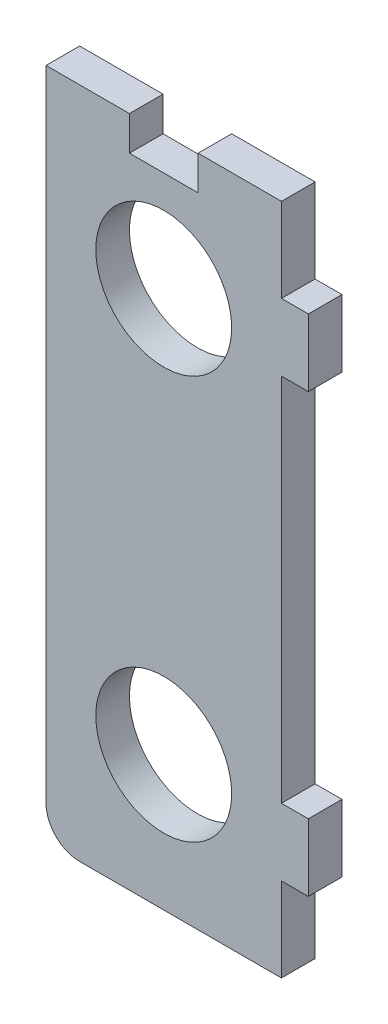
ISO-10303-21;
HEADER;
FILE_DESCRIPTION(('STEP AP214'),'2;1');
FILE_NAME('part.step','',(''),(''),'','','');
FILE_SCHEMA(('AUTOMOTIVE_DESIGN { 1 0 10303 214 1 1 1 1 }'));
ENDSEC;
DATA;
#1=APPLICATION_CONTEXT('core data for automotive mechanical design processes');
#2=APPLICATION_PROTOCOL_DEFINITION('international standard','automotive_design',2000,#1);
#3=PRODUCT_CONTEXT('',#1,'mechanical');
#4=PRODUCT('Part','Part','',(#3));
#5=PRODUCT_RELATED_PRODUCT_CATEGORY('part','',(#4));
#6=PRODUCT_DEFINITION_FORMATION('','',#4);
#7=PRODUCT_DEFINITION_CONTEXT('part definition',#1,'design');
#8=PRODUCT_DEFINITION('design','',#6,#7);
#9=PRODUCT_DEFINITION_SHAPE('','',#8);
#10=(LENGTH_UNIT() NAMED_UNIT(*) SI_UNIT(.MILLI.,.METRE.));
#11=(NAMED_UNIT(*) PLANE_ANGLE_UNIT() SI_UNIT($,.RADIAN.));
#12=(NAMED_UNIT(*) SI_UNIT($,.STERADIAN.) SOLID_ANGLE_UNIT());
#13=UNCERTAINTY_MEASURE_WITH_UNIT(LENGTH_MEASURE(1.E-05),#10,'distance_accuracy_value','');
#14=(GEOMETRIC_REPRESENTATION_CONTEXT(3) GLOBAL_UNCERTAINTY_ASSIGNED_CONTEXT((#13)) GLOBAL_UNIT_ASSIGNED_CONTEXT((#10,
#11,#12)) REPRESENTATION_CONTEXT('',''));
#15=CARTESIAN_POINT('',(0.,0.,0.));
#16=DIRECTION('',(0.,0.,1.));
#17=DIRECTION('',(1.,0.,0.));
#18=AXIS2_PLACEMENT_3D('',#15,#16,#17);
#19=CARTESIAN_POINT('',(-35.,0.,-20.));
#20=DIRECTION('',(-1.,0.,0.));
#21=DIRECTION('',(0.,-1.,0.));
#22=AXIS2_PLACEMENT_3D('',#19,#20,#21);
#23=PLANE('',#22);
#24=DIRECTION('',(0.,0.,-1.));
#25=VECTOR('',#24,1.);
#26=CARTESIAN_POINT('',(-35.,-95.,-20.));
#27=LINE('',#26,#25);
#28=CARTESIAN_POINT('',(-35.,-95.,-15.));
#29=VERTEX_POINT('',#28);
#30=CARTESIAN_POINT('',(-35.,-95.,-20.));
#31=VERTEX_POINT('',#30);
#32=EDGE_CURVE('E11',#29,#31,#27,.T.);
#33=ORIENTED_EDGE('',*,*,#32,.F.);
#34=DIRECTION('',(0.,1.,0.));
#35=VECTOR('',#34,1.);
#36=CARTESIAN_POINT('',(-35.,0.,-15.));
#37=LINE('',#36,#35);
#38=CARTESIAN_POINT('',(-35.,0.,-15.));
#39=VERTEX_POINT('',#38);
#40=EDGE_CURVE('E131',#39,#29,#37,.F.);
#41=ORIENTED_EDGE('',*,*,#40,.F.);
#42=DIRECTION('',(0.,0.,-1.));
#43=VECTOR('',#42,1.);
#44=CARTESIAN_POINT('',(-35.,0.,-20.));
#45=LINE('',#44,#43);
#46=CARTESIAN_POINT('',(-35.,0.,-20.));
#47=VERTEX_POINT('',#46);
#48=EDGE_CURVE('E47',#39,#47,#45,.T.);
#49=ORIENTED_EDGE('',*,*,#48,.T.);
#50=DIRECTION('',(0.,-1.,0.));
#51=VECTOR('',#50,1.);
#52=CARTESIAN_POINT('',(-35.,0.,-20.));
#53=LINE('',#52,#51);
#54=EDGE_CURVE('E226',#47,#31,#53,.T.);
#55=ORIENTED_EDGE('',*,*,#54,.T.);
#56=EDGE_LOOP('',(#33,#41,#49,#55));
#57=FACE_BOUND('',#56,.T.);
#58=ADVANCED_FACE('F37',(#57),#23,.T.);
#59=CARTESIAN_POINT('',(-35.,0.,-20.));
#60=DIRECTION('',(0.,1.,0.));
#61=DIRECTION('',(-1.,0.,0.));
#62=AXIS2_PLACEMENT_3D('',#59,#60,#61);
#63=PLANE('',#62);
#64=ORIENTED_EDGE('',*,*,#48,.F.);
#65=DIRECTION('',(1.,0.,0.));
#66=VECTOR('',#65,1.);
#67=CARTESIAN_POINT('',(0.,0.,-15.));
#68=LINE('',#67,#66);
#69=CARTESIAN_POINT('',(-22.6,0.,-15.));
#70=VERTEX_POINT('',#69);
#71=EDGE_CURVE('E180',#70,#39,#68,.F.);
#72=ORIENTED_EDGE('',*,*,#71,.F.);
#73=DIRECTION('',(0.,0.,-1.));
#74=VECTOR('',#73,1.);
#75=CARTESIAN_POINT('',(-22.6,0.,-20.));
#76=LINE('',#75,#74);
#77=CARTESIAN_POINT('',(-22.6,0.,-20.));
#78=VERTEX_POINT('',#77);
#79=EDGE_CURVE('E219',#70,#78,#76,.T.);
#80=ORIENTED_EDGE('',*,*,#79,.T.);
#81=DIRECTION('',(-1.,0.,0.));
#82=VECTOR('',#81,1.);
#83=CARTESIAN_POINT('',(-35.,0.,-20.));
#84=LINE('',#83,#82);
#85=EDGE_CURVE('E236',#78,#47,#84,.T.);
#86=ORIENTED_EDGE('',*,*,#85,.T.);
#87=EDGE_LOOP('',(#64,#72,#80,#86));
#88=FACE_BOUND('',#87,.T.);
#89=ADVANCED_FACE('F239',(#88),#63,.T.);
#90=CARTESIAN_POINT('',(-22.6,-16.5595774569303,-20.));
#91=DIRECTION('',(1.,0.,0.));
#92=DIRECTION('',(0.,1.,0.));
#93=AXIS2_PLACEMENT_3D('',#90,#91,#92);
#94=PLANE('',#93);
#95=ORIENTED_EDGE('',*,*,#79,.F.);
#96=DIRECTION('',(0.,1.,0.));
#97=VECTOR('',#96,1.);
#98=CARTESIAN_POINT('',(-22.6,0.,-15.));
#99=LINE('',#98,#97);
#100=CARTESIAN_POINT('',(-22.6,-5.1,-15.));
#101=VERTEX_POINT('',#100);
#102=EDGE_CURVE('E177',#101,#70,#99,.T.);
#103=ORIENTED_EDGE('',*,*,#102,.F.);
#104=DIRECTION('',(0.,0.,-1.));
#105=VECTOR('',#104,1.);
#106=CARTESIAN_POINT('',(-22.6,-5.1,-20.));
#107=LINE('',#106,#105);
#108=CARTESIAN_POINT('',(-22.6,-5.1,-20.));
#109=VERTEX_POINT('',#108);
#110=EDGE_CURVE('E216',#101,#109,#107,.T.);
#111=ORIENTED_EDGE('',*,*,#110,.T.);
#112=DIRECTION('',(0.,1.,0.));
#113=VECTOR('',#112,1.);
#114=CARTESIAN_POINT('',(-22.6,-16.5595774569303,-20.));
#115=LINE('',#114,#113);
#116=EDGE_CURVE('E240',#109,#78,#115,.T.);
#117=ORIENTED_EDGE('',*,*,#116,.T.);
#118=EDGE_LOOP('',(#95,#103,#111,#117));
#119=FACE_BOUND('',#118,.T.);
#120=ADVANCED_FACE('F304',(#119),#94,.T.);
#121=CARTESIAN_POINT('',(-12.4,-5.1,-20.));
#122=DIRECTION('',(0.,-1.,0.));
#123=DIRECTION('',(1.,0.,0.));
#124=AXIS2_PLACEMENT_3D('',#121,#122,#123);
#125=PLANE('',#124);
#126=ORIENTED_EDGE('',*,*,#110,.F.);
#127=DIRECTION('',(1.,0.,0.));
#128=VECTOR('',#127,1.);
#129=CARTESIAN_POINT('',(0.,-5.1,-15.));
#130=LINE('',#129,#128);
#131=CARTESIAN_POINT('',(-12.4,-5.1,-15.));
#132=VERTEX_POINT('',#131);
#133=EDGE_CURVE('E174',#101,#132,#130,.T.);
#134=ORIENTED_EDGE('',*,*,#133,.T.);
#135=DIRECTION('',(0.,0.,-1.));
#136=VECTOR('',#135,1.);
#137=CARTESIAN_POINT('',(-12.4,-5.1,-20.));
#138=LINE('',#137,#136);
#139=CARTESIAN_POINT('',(-12.4,-5.1,-20.));
#140=VERTEX_POINT('',#139);
#141=EDGE_CURVE('E213',#132,#140,#138,.T.);
#142=ORIENTED_EDGE('',*,*,#141,.T.);
#143=DIRECTION('',(1.,0.,0.));
#144=VECTOR('',#143,1.);
#145=CARTESIAN_POINT('',(-12.4,-5.1,-20.));
#146=LINE('',#145,#144);
#147=EDGE_CURVE('E243',#109,#140,#146,.T.);
#148=ORIENTED_EDGE('',*,*,#147,.F.);
#149=EDGE_LOOP('',(#126,#134,#142,#148));
#150=FACE_BOUND('',#149,.T.);
#151=ADVANCED_FACE('F310',(#150),#125,.F.);
#152=CARTESIAN_POINT('',(-12.4,-16.5595774569303,-20.));
#153=DIRECTION('',(1.,0.,0.));
#154=DIRECTION('',(0.,1.,0.));
#155=AXIS2_PLACEMENT_3D('',#152,#153,#154);
#156=PLANE('',#155);
#157=ORIENTED_EDGE('',*,*,#141,.F.);
#158=DIRECTION('',(0.,1.,0.));
#159=VECTOR('',#158,1.);
#160=CARTESIAN_POINT('',(-12.4,0.,-15.));
#161=LINE('',#160,#159);
#162=CARTESIAN_POINT('',(-12.4,0.,-15.));
#163=VERTEX_POINT('',#162);
#164=EDGE_CURVE('E171',#132,#163,#161,.T.);
#165=ORIENTED_EDGE('',*,*,#164,.T.);
#166=DIRECTION('',(0.,0.,-1.));
#167=VECTOR('',#166,1.);
#168=CARTESIAN_POINT('',(-12.4,0.,-20.));
#169=LINE('',#168,#167);
#170=CARTESIAN_POINT('',(-12.4,0.,-20.));
#171=VERTEX_POINT('',#170);
#172=EDGE_CURVE('E210',#163,#171,#169,.T.);
#173=ORIENTED_EDGE('',*,*,#172,.T.);
#174=DIRECTION('',(0.,1.,0.));
#175=VECTOR('',#174,1.);
#176=CARTESIAN_POINT('',(-12.4,-16.5595774569303,-20.));
#177=LINE('',#176,#175);
#178=EDGE_CURVE('E247',#140,#171,#177,.T.);
#179=ORIENTED_EDGE('',*,*,#178,.F.);
#180=EDGE_LOOP('',(#157,#165,#173,#179));
#181=FACE_BOUND('',#180,.T.);
#182=ADVANCED_FACE('F314',(#181),#156,.F.);
#183=ORIENTED_EDGE('',*,*,#172,.F.);
#184=DIRECTION('',(1.,0.,0.));
#185=VECTOR('',#184,1.);
#186=CARTESIAN_POINT('',(0.,0.,-15.));
#187=LINE('',#186,#185);
#188=CARTESIAN_POINT('',(0.,0.,-15.));
#189=VERTEX_POINT('',#188);
#190=EDGE_CURVE('E168',#189,#163,#187,.F.);
#191=ORIENTED_EDGE('',*,*,#190,.F.);
#192=DIRECTION('',(0.,0.,-1.));
#193=VECTOR('',#192,1.);
#194=CARTESIAN_POINT('',(0.,0.,-20.));
#195=LINE('',#194,#193);
#196=CARTESIAN_POINT('',(0.,0.,-20.));
#197=VERTEX_POINT('',#196);
#198=EDGE_CURVE('E207',#189,#197,#195,.T.);
#199=ORIENTED_EDGE('',*,*,#198,.T.);
#200=EDGE_CURVE('E242',#197,#171,#84,.T.);
#201=ORIENTED_EDGE('',*,*,#200,.T.);
#202=EDGE_LOOP('',(#183,#191,#199,#201));
#203=FACE_BOUND('',#202,.T.);
#204=ADVANCED_FACE('F306',(#203),#63,.T.);
#205=CARTESIAN_POINT('',(0.,0.,-20.));
#206=DIRECTION('',(1.,0.,0.));
#207=DIRECTION('',(0.,1.,0.));
#208=AXIS2_PLACEMENT_3D('',#205,#206,#207);
#209=PLANE('',#208);
#210=ORIENTED_EDGE('',*,*,#198,.F.);
#211=DIRECTION('',(0.,1.,0.));
#212=VECTOR('',#211,1.);
#213=CARTESIAN_POINT('',(0.,0.,-15.));
#214=LINE('',#213,#212);
#215=CARTESIAN_POINT('',(0.,-12.5,-15.));
#216=VERTEX_POINT('',#215);
#217=EDGE_CURVE('E165',#216,#189,#214,.T.);
#218=ORIENTED_EDGE('',*,*,#217,.F.);
#219=DIRECTION('',(0.,0.,-1.));
#220=VECTOR('',#219,1.);
#221=CARTESIAN_POINT('',(0.,-12.5,-20.));
#222=LINE('',#221,#220);
#223=CARTESIAN_POINT('',(0.,-12.5,-20.));
#224=VERTEX_POINT('',#223);
#225=EDGE_CURVE('E204',#216,#224,#222,.T.);
#226=ORIENTED_EDGE('',*,*,#225,.T.);
#227=DIRECTION('',(0.,1.,0.));
#228=VECTOR('',#227,1.);
#229=CARTESIAN_POINT('',(0.,0.,-20.));
#230=LINE('',#229,#228);
#231=EDGE_CURVE('E246',#224,#197,#230,.T.);
#232=ORIENTED_EDGE('',*,*,#231,.T.);
#233=EDGE_LOOP('',(#210,#218,#226,#232));
#234=FACE_BOUND('',#233,.T.);
#235=ADVANCED_FACE('F320',(#234),#209,.T.);
#236=CARTESIAN_POINT('',(4.,-12.5,-20.));
#237=DIRECTION('',(0.,1.,0.));
#238=DIRECTION('',(-1.,0.,0.));
#239=AXIS2_PLACEMENT_3D('',#236,#237,#238);
#240=PLANE('',#239);
#241=ORIENTED_EDGE('',*,*,#225,.F.);
#242=DIRECTION('',(1.,0.,0.));
#243=VECTOR('',#242,1.);
#244=CARTESIAN_POINT('',(0.,-12.5,-15.));
#245=LINE('',#244,#243);
#246=CARTESIAN_POINT('',(4.,-12.5,-15.));
#247=VERTEX_POINT('',#246);
#248=EDGE_CURVE('E162',#247,#216,#245,.F.);
#249=ORIENTED_EDGE('',*,*,#248,.F.);
#250=DIRECTION('',(0.,0.,-1.));
#251=VECTOR('',#250,1.);
#252=CARTESIAN_POINT('',(4.,-12.5,-20.));
#253=LINE('',#252,#251);
#254=CARTESIAN_POINT('',(4.,-12.5,-20.));
#255=VERTEX_POINT('',#254);
#256=EDGE_CURVE('E201',#247,#255,#253,.T.);
#257=ORIENTED_EDGE('',*,*,#256,.T.);
#258=DIRECTION('',(-1.,0.,0.));
#259=VECTOR('',#258,1.);
#260=CARTESIAN_POINT('',(4.,-12.5,-20.));
#261=LINE('',#260,#259);
#262=EDGE_CURVE('E252',#255,#224,#261,.T.);
#263=ORIENTED_EDGE('',*,*,#262,.T.);
#264=EDGE_LOOP('',(#241,#249,#257,#263));
#265=FACE_BOUND('',#264,.T.);
#266=ADVANCED_FACE('F323',(#265),#240,.T.);
#267=CARTESIAN_POINT('',(4.,-22.5,-20.));
#268=DIRECTION('',(1.,0.,0.));
#269=DIRECTION('',(0.,1.,0.));
#270=AXIS2_PLACEMENT_3D('',#267,#268,#269);
#271=PLANE('',#270);
#272=ORIENTED_EDGE('',*,*,#256,.F.);
#273=DIRECTION('',(0.,1.,0.));
#274=VECTOR('',#273,1.);
#275=CARTESIAN_POINT('',(4.,0.,-15.));
#276=LINE('',#275,#274);
#277=CARTESIAN_POINT('',(4.,-22.5,-15.));
#278=VERTEX_POINT('',#277);
#279=EDGE_CURVE('E159',#278,#247,#276,.T.);
#280=ORIENTED_EDGE('',*,*,#279,.F.);
#281=DIRECTION('',(0.,0.,-1.));
#282=VECTOR('',#281,1.);
#283=CARTESIAN_POINT('',(4.,-22.5,-20.));
#284=LINE('',#283,#282);
#285=CARTESIAN_POINT('',(4.,-22.5,-20.));
#286=VERTEX_POINT('',#285);
#287=EDGE_CURVE('E198',#278,#286,#284,.T.);
#288=ORIENTED_EDGE('',*,*,#287,.T.);
#289=DIRECTION('',(0.,1.,0.));
#290=VECTOR('',#289,1.);
#291=CARTESIAN_POINT('',(4.,-22.5,-20.));
#292=LINE('',#291,#290);
#293=EDGE_CURVE('E262',#286,#255,#292,.T.);
#294=ORIENTED_EDGE('',*,*,#293,.T.);
#295=EDGE_LOOP('',(#272,#280,#288,#294));
#296=FACE_BOUND('',#295,.T.);
#297=ADVANCED_FACE('F327',(#296),#271,.T.);
#298=CARTESIAN_POINT('',(0.,-22.5,-20.));
#299=DIRECTION('',(0.,-1.,0.));
#300=DIRECTION('',(1.,0.,0.));
#301=AXIS2_PLACEMENT_3D('',#298,#299,#300);
#302=PLANE('',#301);
#303=ORIENTED_EDGE('',*,*,#287,.F.);
#304=DIRECTION('',(1.,0.,0.));
#305=VECTOR('',#304,1.);
#306=CARTESIAN_POINT('',(0.,-22.5,-15.));
#307=LINE('',#306,#305);
#308=CARTESIAN_POINT('',(0.,-22.5,-15.));
#309=VERTEX_POINT('',#308);
#310=EDGE_CURVE('E156',#309,#278,#307,.T.);
#311=ORIENTED_EDGE('',*,*,#310,.F.);
#312=DIRECTION('',(0.,0.,-1.));
#313=VECTOR('',#312,1.);
#314=CARTESIAN_POINT('',(0.,-22.5,-20.));
#315=LINE('',#314,#313);
#316=CARTESIAN_POINT('',(0.,-22.5,-20.));
#317=VERTEX_POINT('',#316);
#318=EDGE_CURVE('E195',#309,#317,#315,.T.);
#319=ORIENTED_EDGE('',*,*,#318,.T.);
#320=DIRECTION('',(1.,0.,0.));
#321=VECTOR('',#320,1.);
#322=CARTESIAN_POINT('',(0.,-22.5,-20.));
#323=LINE('',#322,#321);
#324=EDGE_CURVE('E265',#317,#286,#323,.T.);
#325=ORIENTED_EDGE('',*,*,#324,.T.);
#326=EDGE_LOOP('',(#303,#311,#319,#325));
#327=FACE_BOUND('',#326,.T.);
#328=ADVANCED_FACE('F331',(#327),#302,.T.);
#329=CARTESIAN_POINT('',(0.,-77.5,-20.));
#330=DIRECTION('',(1.,0.,0.));
#331=DIRECTION('',(0.,1.,0.));
#332=AXIS2_PLACEMENT_3D('',#329,#330,#331);
#333=PLANE('',#332);
#334=ORIENTED_EDGE('',*,*,#318,.F.);
#335=DIRECTION('',(0.,1.,0.));
#336=VECTOR('',#335,1.);
#337=CARTESIAN_POINT('',(0.,0.,-15.));
#338=LINE('',#337,#336);
#339=CARTESIAN_POINT('',(0.,-77.5,-15.));
#340=VERTEX_POINT('',#339);
#341=EDGE_CURVE('E153',#340,#309,#338,.T.);
#342=ORIENTED_EDGE('',*,*,#341,.F.);
#343=DIRECTION('',(0.,0.,-1.));
#344=VECTOR('',#343,1.);
#345=CARTESIAN_POINT('',(0.,-77.5,-20.));
#346=LINE('',#345,#344);
#347=CARTESIAN_POINT('',(0.,-77.5,-20.));
#348=VERTEX_POINT('',#347);
#349=EDGE_CURVE('E192',#340,#348,#346,.T.);
#350=ORIENTED_EDGE('',*,*,#349,.T.);
#351=DIRECTION('',(0.,1.,0.));
#352=VECTOR('',#351,1.);
#353=CARTESIAN_POINT('',(0.,-77.5,-20.));
#354=LINE('',#353,#352);
#355=EDGE_CURVE('E268',#348,#317,#354,.T.);
#356=ORIENTED_EDGE('',*,*,#355,.T.);
#357=EDGE_LOOP('',(#334,#342,#350,#356));
#358=FACE_BOUND('',#357,.T.);
#359=ADVANCED_FACE('F335',(#358),#333,.T.);
#360=CARTESIAN_POINT('',(4.,-77.5,-20.));
#361=DIRECTION('',(0.,1.,0.));
#362=DIRECTION('',(-1.,0.,0.));
#363=AXIS2_PLACEMENT_3D('',#360,#361,#362);
#364=PLANE('',#363);
#365=ORIENTED_EDGE('',*,*,#349,.F.);
#366=DIRECTION('',(1.,0.,0.));
#367=VECTOR('',#366,1.);
#368=CARTESIAN_POINT('',(0.,-77.5,-15.));
#369=LINE('',#368,#367);
#370=CARTESIAN_POINT('',(4.,-77.5,-15.));
#371=VERTEX_POINT('',#370);
#372=EDGE_CURVE('E150',#371,#340,#369,.F.);
#373=ORIENTED_EDGE('',*,*,#372,.F.);
#374=DIRECTION('',(0.,0.,-1.));
#375=VECTOR('',#374,1.);
#376=CARTESIAN_POINT('',(4.,-77.5,-20.));
#377=LINE('',#376,#375);
#378=CARTESIAN_POINT('',(4.,-77.5,-20.));
#379=VERTEX_POINT('',#378);
#380=EDGE_CURVE('E189',#371,#379,#377,.T.);
#381=ORIENTED_EDGE('',*,*,#380,.T.);
#382=DIRECTION('',(-1.,0.,0.));
#383=VECTOR('',#382,1.);
#384=CARTESIAN_POINT('',(4.,-77.5,-20.));
#385=LINE('',#384,#383);
#386=EDGE_CURVE('E271',#379,#348,#385,.T.);
#387=ORIENTED_EDGE('',*,*,#386,.T.);
#388=EDGE_LOOP('',(#365,#373,#381,#387));
#389=FACE_BOUND('',#388,.T.);
#390=ADVANCED_FACE('F339',(#389),#364,.T.);
#391=CARTESIAN_POINT('',(4.,-87.5,-20.));
#392=DIRECTION('',(1.,0.,0.));
#393=DIRECTION('',(0.,1.,0.));
#394=AXIS2_PLACEMENT_3D('',#391,#392,#393);
#395=PLANE('',#394);
#396=ORIENTED_EDGE('',*,*,#380,.F.);
#397=DIRECTION('',(0.,1.,0.));
#398=VECTOR('',#397,1.);
#399=CARTESIAN_POINT('',(4.,0.,-15.));
#400=LINE('',#399,#398);
#401=CARTESIAN_POINT('',(4.,-87.5,-15.));
#402=VERTEX_POINT('',#401);
#403=EDGE_CURVE('E147',#402,#371,#400,.T.);
#404=ORIENTED_EDGE('',*,*,#403,.F.);
#405=DIRECTION('',(0.,0.,-1.));
#406=VECTOR('',#405,1.);
#407=CARTESIAN_POINT('',(4.,-87.5,-20.));
#408=LINE('',#407,#406);
#409=CARTESIAN_POINT('',(4.,-87.5,-20.));
#410=VERTEX_POINT('',#409);
#411=EDGE_CURVE('E186',#402,#410,#408,.T.);
#412=ORIENTED_EDGE('',*,*,#411,.T.);
#413=DIRECTION('',(0.,1.,0.));
#414=VECTOR('',#413,1.);
#415=CARTESIAN_POINT('',(4.,-87.5,-20.));
#416=LINE('',#415,#414);
#417=EDGE_CURVE('E274',#410,#379,#416,.T.);
#418=ORIENTED_EDGE('',*,*,#417,.T.);
#419=EDGE_LOOP('',(#396,#404,#412,#418));
#420=FACE_BOUND('',#419,.T.);
#421=ADVANCED_FACE('F343',(#420),#395,.T.);
#422=CARTESIAN_POINT('',(4.,-87.5,-20.));
#423=DIRECTION('',(0.,-1.,0.));
#424=DIRECTION('',(1.,0.,0.));
#425=AXIS2_PLACEMENT_3D('',#422,#423,#424);
#426=PLANE('',#425);
#427=ORIENTED_EDGE('',*,*,#411,.F.);
#428=DIRECTION('',(1.,0.,0.));
#429=VECTOR('',#428,1.);
#430=CARTESIAN_POINT('',(0.,-87.5,-15.));
#431=LINE('',#430,#429);
#432=CARTESIAN_POINT('',(0.,-87.5,-15.));
#433=VERTEX_POINT('',#432);
#434=EDGE_CURVE('E144',#433,#402,#431,.T.);
#435=ORIENTED_EDGE('',*,*,#434,.F.);
#436=DIRECTION('',(0.,0.,-1.));
#437=VECTOR('',#436,1.);
#438=CARTESIAN_POINT('',(0.,-87.5,-20.));
#439=LINE('',#438,#437);
#440=CARTESIAN_POINT('',(0.,-87.5,-20.));
#441=VERTEX_POINT('',#440);
#442=EDGE_CURVE('E184',#433,#441,#439,.T.);
#443=ORIENTED_EDGE('',*,*,#442,.T.);
#444=DIRECTION('',(1.,0.,0.));
#445=VECTOR('',#444,1.);
#446=CARTESIAN_POINT('',(4.,-87.5,-20.));
#447=LINE('',#446,#445);
#448=EDGE_CURVE('E277',#441,#410,#447,.T.);
#449=ORIENTED_EDGE('',*,*,#448,.T.);
#450=EDGE_LOOP('',(#427,#435,#443,#449));
#451=FACE_BOUND('',#450,.T.);
#452=ADVANCED_FACE('F347',(#451),#426,.T.);
#453=CARTESIAN_POINT('',(0.,-87.5,-20.));
#454=DIRECTION('',(1.,0.,0.));
#455=DIRECTION('',(0.,1.,0.));
#456=AXIS2_PLACEMENT_3D('',#453,#454,#455);
#457=PLANE('',#456);
#458=ORIENTED_EDGE('',*,*,#442,.F.);
#459=DIRECTION('',(0.,1.,0.));
#460=VECTOR('',#459,1.);
#461=CARTESIAN_POINT('',(0.,0.,-15.));
#462=LINE('',#461,#460);
#463=CARTESIAN_POINT('',(0.,-100.,-15.));
#464=VERTEX_POINT('',#463);
#465=EDGE_CURVE('E141',#464,#433,#462,.T.);
#466=ORIENTED_EDGE('',*,*,#465,.F.);
#467=DIRECTION('',(0.,0.,-1.));
#468=VECTOR('',#467,1.);
#469=CARTESIAN_POINT('',(0.,-100.,-20.));
#470=LINE('',#469,#468);
#471=CARTESIAN_POINT('',(0.,-100.,-20.));
#472=VERTEX_POINT('',#471);
#473=EDGE_CURVE('E55',#464,#472,#470,.T.);
#474=ORIENTED_EDGE('',*,*,#473,.T.);
#475=DIRECTION('',(0.,1.,0.));
#476=VECTOR('',#475,1.);
#477=CARTESIAN_POINT('',(0.,-87.5,-20.));
#478=LINE('',#477,#476);
#479=EDGE_CURVE('E124',#472,#441,#478,.T.);
#480=ORIENTED_EDGE('',*,*,#479,.T.);
#481=EDGE_LOOP('',(#458,#466,#474,#480));
#482=FACE_BOUND('',#481,.T.);
#483=ADVANCED_FACE('F296',(#482),#457,.T.);
#484=CARTESIAN_POINT('',(-35.,-100.,-20.));
#485=DIRECTION('',(0.,-1.,0.));
#486=DIRECTION('',(1.,0.,0.));
#487=AXIS2_PLACEMENT_3D('',#484,#485,#486);
#488=PLANE('',#487);
#489=ORIENTED_EDGE('',*,*,#473,.F.);
#490=DIRECTION('',(1.,0.,0.));
#491=VECTOR('',#490,1.);
#492=CARTESIAN_POINT('',(0.,-100.,-15.));
#493=LINE('',#492,#491);
#494=CARTESIAN_POINT('',(-30.,-100.,-15.));
#495=VERTEX_POINT('',#494);
#496=EDGE_CURVE('E129',#495,#464,#493,.T.);
#497=ORIENTED_EDGE('',*,*,#496,.F.);
#498=DIRECTION('',(0.,0.,-1.));
#499=VECTOR('',#498,1.);
#500=CARTESIAN_POINT('',(-30.,-100.,-20.));
#501=LINE('',#500,#499);
#502=CARTESIAN_POINT('',(-30.,-100.,-20.));
#503=VERTEX_POINT('',#502);
#504=EDGE_CURVE('E41',#495,#503,#501,.T.);
#505=ORIENTED_EDGE('',*,*,#504,.T.);
#506=DIRECTION('',(1.,0.,0.));
#507=VECTOR('',#506,1.);
#508=CARTESIAN_POINT('',(-35.,-100.,-20.));
#509=LINE('',#508,#507);
#510=EDGE_CURVE('E399',#503,#472,#509,.T.);
#511=ORIENTED_EDGE('',*,*,#510,.T.);
#512=EDGE_LOOP('',(#489,#497,#505,#511));
#513=FACE_BOUND('',#512,.T.);
#514=ADVANCED_FACE('F133',(#513),#488,.T.);
#515=CARTESIAN_POINT('',(-17.5,-20.,-20.));
#516=DIRECTION('',(0.,0.,1.));
#517=DIRECTION('',(1.,0.,0.));
#518=AXIS2_PLACEMENT_3D('',#515,#516,#517);
#519=CYLINDRICAL_SURFACE('',#518,10.1);
#520=CARTESIAN_POINT('',(-17.5,-20.,-20.));
#521=DIRECTION('',(0.,0.,-1.));
#522=DIRECTION('',(-1.,0.,0.));
#523=AXIS2_PLACEMENT_3D('',#520,#521,#522);
#524=CIRCLE('',#523,10.1);
#525=CARTESIAN_POINT('',(-27.6,-20.,-20.));
#526=VERTEX_POINT('',#525);
#527=EDGE_CURVE('E143',#526,#526,#524,.T.);
#528=ORIENTED_EDGE('',*,*,#527,.T.);
#529=EDGE_LOOP('',(#528));
#530=FACE_BOUND('',#529,.T.);
#531=CARTESIAN_POINT('',(-17.5,-20.,-15.));
#532=DIRECTION('',(0.,0.,-1.));
#533=DIRECTION('',(-1.,0.,0.));
#534=AXIS2_PLACEMENT_3D('',#531,#532,#533);
#535=CIRCLE('',#534,10.1);
#536=CARTESIAN_POINT('',(-27.6,-20.,-15.));
#537=VERTEX_POINT('',#536);
#538=EDGE_CURVE('E137',#537,#537,#535,.T.);
#539=ORIENTED_EDGE('',*,*,#538,.F.);
#540=EDGE_LOOP('',(#539));
#541=FACE_BOUND('',#540,.T.);
#542=ADVANCED_FACE('F285',(#530,#541),#519,.F.);
#543=CARTESIAN_POINT('',(-17.5,-80.,-20.));
#544=DIRECTION('',(0.,0.,1.));
#545=DIRECTION('',(1.,0.,0.));
#546=AXIS2_PLACEMENT_3D('',#543,#544,#545);
#547=CYLINDRICAL_SURFACE('',#546,10.1);
#548=CARTESIAN_POINT('',(-17.5,-80.,-20.));
#549=DIRECTION('',(0.,0.,-1.));
#550=DIRECTION('',(-1.,0.,0.));
#551=AXIS2_PLACEMENT_3D('',#548,#549,#550);
#552=CIRCLE('',#551,10.1);
#553=CARTESIAN_POINT('',(-27.6,-80.,-20.));
#554=VERTEX_POINT('',#553);
#555=EDGE_CURVE('E400',#554,#554,#552,.T.);
#556=ORIENTED_EDGE('',*,*,#555,.T.);
#557=EDGE_LOOP('',(#556));
#558=FACE_BOUND('',#557,.T.);
#559=CARTESIAN_POINT('',(-17.5,-80.,-15.));
#560=DIRECTION('',(0.,0.,-1.));
#561=DIRECTION('',(-1.,0.,0.));
#562=AXIS2_PLACEMENT_3D('',#559,#560,#561);
#563=CIRCLE('',#562,10.1);
#564=CARTESIAN_POINT('',(-27.6,-80.,-15.));
#565=VERTEX_POINT('',#564);
#566=EDGE_CURVE('E134',#565,#565,#563,.T.);
#567=ORIENTED_EDGE('',*,*,#566,.F.);
#568=EDGE_LOOP('',(#567));
#569=FACE_BOUND('',#568,.T.);
#570=ADVANCED_FACE('F287',(#558,#569),#547,.F.);
#571=CARTESIAN_POINT('',(-30.,-95.,-20.));
#572=DIRECTION('',(0.,0.,1.));
#573=DIRECTION('',(1.,0.,0.));
#574=AXIS2_PLACEMENT_3D('',#571,#572,#573);
#575=CYLINDRICAL_SURFACE('',#574,5.);
#576=CARTESIAN_POINT('',(-30.,-95.,-15.));
#577=DIRECTION('',(0.,0.,1.));
#578=DIRECTION('',(1.,0.,0.));
#579=AXIS2_PLACEMENT_3D('',#576,#577,#578);
#580=CIRCLE('',#579,5.);
#581=EDGE_CURVE('E118',#495,#29,#580,.F.);
#582=ORIENTED_EDGE('',*,*,#581,.T.);
#583=ORIENTED_EDGE('',*,*,#32,.T.);
#584=CARTESIAN_POINT('',(-30.,-95.,-20.));
#585=DIRECTION('',(0.,0.,1.));
#586=DIRECTION('',(1.,0.,0.));
#587=AXIS2_PLACEMENT_3D('',#584,#585,#586);
#588=CIRCLE('',#587,5.);
#589=EDGE_CURVE('E120',#503,#31,#588,.F.);
#590=ORIENTED_EDGE('',*,*,#589,.F.);
#591=ORIENTED_EDGE('',*,*,#504,.F.);
#592=EDGE_LOOP('',(#582,#583,#590,#591));
#593=FACE_BOUND('',#592,.T.);
#594=ADVANCED_FACE('F39',(#593),#575,.T.);
#595=CARTESIAN_POINT('',(0.,0.,-20.));
#596=DIRECTION('',(0.,0.,1.));
#597=DIRECTION('',(1.,0.,0.));
#598=AXIS2_PLACEMENT_3D('',#595,#596,#597);
#599=PLANE('',#598);
#600=ORIENTED_EDGE('',*,*,#527,.F.);
#601=EDGE_LOOP('',(#600));
#602=FACE_BOUND('',#601,.T.);
#603=ORIENTED_EDGE('',*,*,#555,.F.);
#604=EDGE_LOOP('',(#603));
#605=FACE_BOUND('',#604,.T.);
#606=ORIENTED_EDGE('',*,*,#510,.F.);
#607=ORIENTED_EDGE('',*,*,#589,.T.);
#608=ORIENTED_EDGE('',*,*,#54,.F.);
#609=ORIENTED_EDGE('',*,*,#85,.F.);
#610=ORIENTED_EDGE('',*,*,#116,.F.);
#611=ORIENTED_EDGE('',*,*,#147,.T.);
#612=ORIENTED_EDGE('',*,*,#178,.T.);
#613=ORIENTED_EDGE('',*,*,#200,.F.);
#614=ORIENTED_EDGE('',*,*,#231,.F.);
#615=ORIENTED_EDGE('',*,*,#262,.F.);
#616=ORIENTED_EDGE('',*,*,#293,.F.);
#617=ORIENTED_EDGE('',*,*,#324,.F.);
#618=ORIENTED_EDGE('',*,*,#355,.F.);
#619=ORIENTED_EDGE('',*,*,#386,.F.);
#620=ORIENTED_EDGE('',*,*,#417,.F.);
#621=ORIENTED_EDGE('',*,*,#448,.F.);
#622=ORIENTED_EDGE('',*,*,#479,.F.);
#623=EDGE_LOOP('',(#606,#607,#608,#609,#610,#611,#612,#613,#614,#615,#616,#617,#618,#619,#620,
#621,#622));
#624=FACE_BOUND('',#623,.T.);
#625=ADVANCED_FACE('F234',(#602,#605,#624),#599,.F.);
#626=CARTESIAN_POINT('',(0.,0.,-15.));
#627=DIRECTION('',(0.,0.,1.));
#628=DIRECTION('',(1.,0.,0.));
#629=AXIS2_PLACEMENT_3D('',#626,#627,#628);
#630=PLANE('',#629);
#631=ORIENTED_EDGE('',*,*,#538,.T.);
#632=EDGE_LOOP('',(#631));
#633=FACE_BOUND('',#632,.T.);
#634=ORIENTED_EDGE('',*,*,#566,.T.);
#635=EDGE_LOOP('',(#634));
#636=FACE_BOUND('',#635,.T.);
#637=ORIENTED_EDGE('',*,*,#496,.T.);
#638=ORIENTED_EDGE('',*,*,#465,.T.);
#639=ORIENTED_EDGE('',*,*,#434,.T.);
#640=ORIENTED_EDGE('',*,*,#403,.T.);
#641=ORIENTED_EDGE('',*,*,#372,.T.);
#642=ORIENTED_EDGE('',*,*,#341,.T.);
#643=ORIENTED_EDGE('',*,*,#310,.T.);
#644=ORIENTED_EDGE('',*,*,#279,.T.);
#645=ORIENTED_EDGE('',*,*,#248,.T.);
#646=ORIENTED_EDGE('',*,*,#217,.T.);
#647=ORIENTED_EDGE('',*,*,#190,.T.);
#648=ORIENTED_EDGE('',*,*,#164,.F.);
#649=ORIENTED_EDGE('',*,*,#133,.F.);
#650=ORIENTED_EDGE('',*,*,#102,.T.);
#651=ORIENTED_EDGE('',*,*,#71,.T.);
#652=ORIENTED_EDGE('',*,*,#40,.T.);
#653=ORIENTED_EDGE('',*,*,#581,.F.);
#654=EDGE_LOOP('',(#637,#638,#639,#640,#641,#642,#643,#644,#645,#646,#647,#648,#649,#650,#651,
#652,#653));
#655=FACE_BOUND('',#654,.T.);
#656=ADVANCED_FACE('F127',(#633,#636,#655),#630,.T.);
#657=CLOSED_SHELL('',(#58,#89,#120,#151,#182,#204,#235,#266,#297,#328,#359,#390,#421,#452,#483,
#514,#542,#570,#594,#625,#656));
#658=MANIFOLD_SOLID_BREP('B2',#657);
#659=ADVANCED_BREP_SHAPE_REPRESENTATION('',(#18,#658),#14);
#660=SHAPE_DEFINITION_REPRESENTATION(#9,#659);
ENDSEC;
END-ISO-10303-21;
